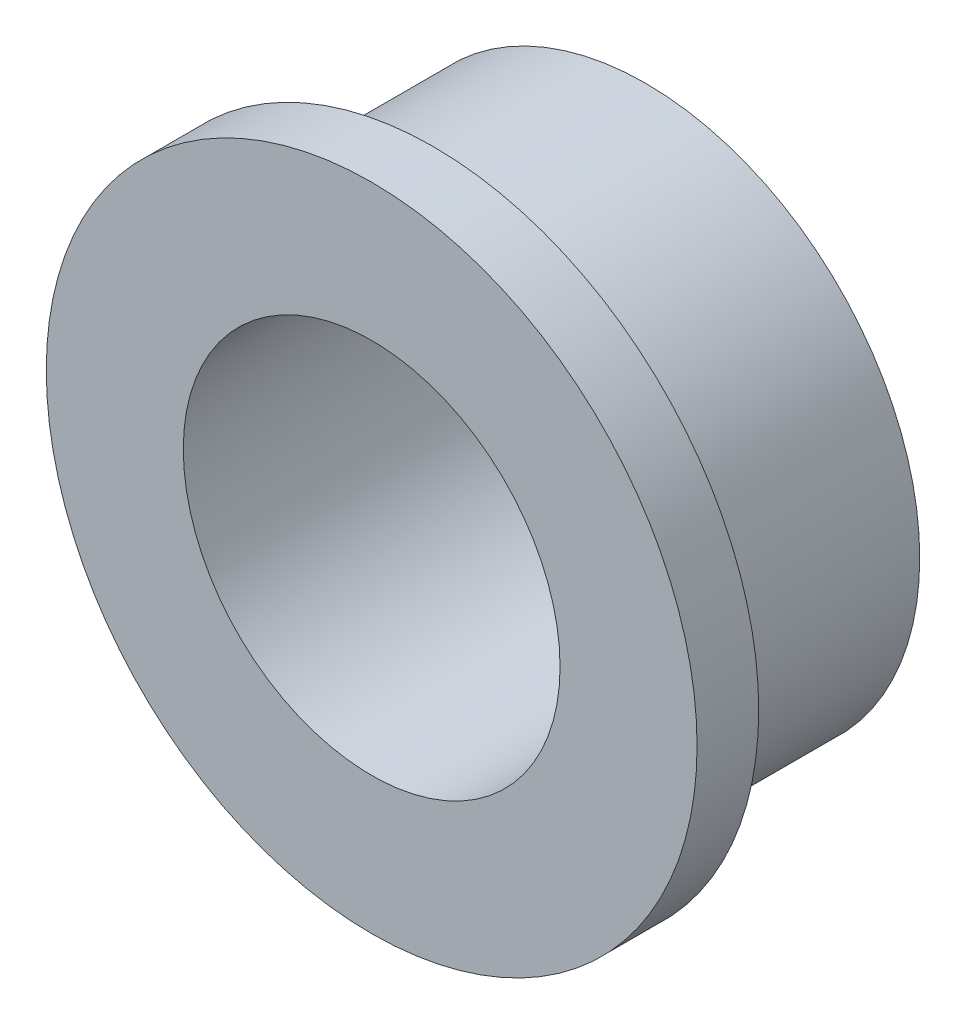
ISO-10303-21;
HEADER;
FILE_DESCRIPTION(('STEP AP214'),'2;1');
FILE_NAME('part.step','',(''),(''),'','','');
FILE_SCHEMA(('AUTOMOTIVE_DESIGN { 1 0 10303 214 1 1 1 1 }'));
ENDSEC;
DATA;
#1=APPLICATION_CONTEXT('core data for automotive mechanical design processes');
#2=APPLICATION_PROTOCOL_DEFINITION('international standard','automotive_design',2000,#1);
#3=PRODUCT_CONTEXT('',#1,'mechanical');
#4=PRODUCT('Part','Part','',(#3));
#5=PRODUCT_RELATED_PRODUCT_CATEGORY('part','',(#4));
#6=PRODUCT_DEFINITION_FORMATION('','',#4);
#7=PRODUCT_DEFINITION_CONTEXT('part definition',#1,'design');
#8=PRODUCT_DEFINITION('design','',#6,#7);
#9=PRODUCT_DEFINITION_SHAPE('','',#8);
#10=(LENGTH_UNIT() NAMED_UNIT(*) SI_UNIT(.MILLI.,.METRE.));
#11=(NAMED_UNIT(*) PLANE_ANGLE_UNIT() SI_UNIT($,.RADIAN.));
#12=(NAMED_UNIT(*) SI_UNIT($,.STERADIAN.) SOLID_ANGLE_UNIT());
#13=UNCERTAINTY_MEASURE_WITH_UNIT(LENGTH_MEASURE(1.E-05),#10,'distance_accuracy_value','');
#14=(GEOMETRIC_REPRESENTATION_CONTEXT(3) GLOBAL_UNCERTAINTY_ASSIGNED_CONTEXT((#13)) GLOBAL_UNIT_ASSIGNED_CONTEXT((#10,
#11,#12)) REPRESENTATION_CONTEXT('',''));
#15=CARTESIAN_POINT('',(0.,0.,0.));
#16=DIRECTION('',(0.,0.,1.));
#17=DIRECTION('',(1.,0.,0.));
#18=AXIS2_PLACEMENT_3D('',#15,#16,#17);
#19=CARTESIAN_POINT('',(0.,0.,3.1));
#20=DIRECTION('',(0.,0.,-1.));
#21=DIRECTION('',(-1.,0.,0.));
#22=AXIS2_PLACEMENT_3D('',#19,#20,#21);
#23=CYLINDRICAL_SURFACE('',#22,4.);
#24=CARTESIAN_POINT('',(0.,0.,3.1));
#25=DIRECTION('',(0.,0.,1.));
#26=DIRECTION('',(1.,0.,0.));
#27=AXIS2_PLACEMENT_3D('',#24,#25,#26);
#28=CIRCLE('',#27,4.);
#29=CARTESIAN_POINT('',(4.,0.,3.1));
#30=VERTEX_POINT('',#29);
#31=EDGE_CURVE('E10',#30,#30,#28,.T.);
#32=ORIENTED_EDGE('',*,*,#31,.F.);
#33=EDGE_LOOP('',(#32));
#34=FACE_BOUND('',#33,.T.);
#35=CARTESIAN_POINT('',(0.,0.,0.));
#36=DIRECTION('',(0.,0.,1.));
#37=DIRECTION('',(1.,0.,0.));
#38=AXIS2_PLACEMENT_3D('',#35,#36,#37);
#39=CIRCLE('',#38,4.);
#40=CARTESIAN_POINT('',(4.,0.,0.));
#41=VERTEX_POINT('',#40);
#42=EDGE_CURVE('E37',#41,#41,#39,.T.);
#43=ORIENTED_EDGE('',*,*,#42,.T.);
#44=EDGE_LOOP('',(#43));
#45=FACE_BOUND('',#44,.T.);
#46=ADVANCED_FACE('F34',(#34,#45),#23,.T.);
#47=CARTESIAN_POINT('',(0.,0.,0.));
#48=DIRECTION('',(0.,0.,1.));
#49=DIRECTION('',(1.,0.,0.));
#50=AXIS2_PLACEMENT_3D('',#47,#48,#49);
#51=PLANE('',#50);
#52=CARTESIAN_POINT('',(0.,0.,0.));
#53=DIRECTION('',(0.,0.,-1.));
#54=DIRECTION('',(-1.,0.,0.));
#55=AXIS2_PLACEMENT_3D('',#52,#53,#54);
#56=CIRCLE('',#55,2.75);
#57=CARTESIAN_POINT('',(-2.75,0.,0.));
#58=VERTEX_POINT('',#57);
#59=EDGE_CURVE('E52',#58,#58,#56,.T.);
#60=ORIENTED_EDGE('',*,*,#59,.F.);
#61=EDGE_LOOP('',(#60));
#62=FACE_BOUND('',#61,.T.);
#63=ORIENTED_EDGE('',*,*,#42,.F.);
#64=EDGE_LOOP('',(#63));
#65=FACE_BOUND('',#64,.T.);
#66=ADVANCED_FACE('F68',(#62,#65),#51,.F.);
#67=CARTESIAN_POINT('',(0.,0.,4.));
#68=DIRECTION('',(0.,0.,-1.));
#69=DIRECTION('',(-1.,0.,0.));
#70=AXIS2_PLACEMENT_3D('',#67,#68,#69);
#71=CYLINDRICAL_SURFACE('',#70,4.75);
#72=CARTESIAN_POINT('',(0.,0.,4.));
#73=DIRECTION('',(0.,0.,1.));
#74=DIRECTION('',(1.,0.,0.));
#75=AXIS2_PLACEMENT_3D('',#72,#73,#74);
#76=CIRCLE('',#75,4.75);
#77=CARTESIAN_POINT('',(4.75,0.,4.));
#78=VERTEX_POINT('',#77);
#79=EDGE_CURVE('E44',#78,#78,#76,.T.);
#80=ORIENTED_EDGE('',*,*,#79,.F.);
#81=EDGE_LOOP('',(#80));
#82=FACE_BOUND('',#81,.T.);
#83=CARTESIAN_POINT('',(0.,0.,3.1));
#84=DIRECTION('',(0.,0.,1.));
#85=DIRECTION('',(1.,0.,0.));
#86=AXIS2_PLACEMENT_3D('',#83,#84,#85);
#87=CIRCLE('',#86,4.75);
#88=CARTESIAN_POINT('',(4.75,0.,3.1));
#89=VERTEX_POINT('',#88);
#90=EDGE_CURVE('E46',#89,#89,#87,.T.);
#91=ORIENTED_EDGE('',*,*,#90,.T.);
#92=EDGE_LOOP('',(#91));
#93=FACE_BOUND('',#92,.T.);
#94=ADVANCED_FACE('F71',(#82,#93),#71,.T.);
#95=CARTESIAN_POINT('',(0.,0.,4.));
#96=DIRECTION('',(0.,0.,1.));
#97=DIRECTION('',(1.,0.,0.));
#98=AXIS2_PLACEMENT_3D('',#95,#96,#97);
#99=PLANE('',#98);
#100=CARTESIAN_POINT('',(0.,0.,4.));
#101=DIRECTION('',(0.,0.,-1.));
#102=DIRECTION('',(-1.,0.,0.));
#103=AXIS2_PLACEMENT_3D('',#100,#101,#102);
#104=CIRCLE('',#103,2.75);
#105=CARTESIAN_POINT('',(-2.75,0.,4.));
#106=VERTEX_POINT('',#105);
#107=EDGE_CURVE('E49',#106,#106,#104,.T.);
#108=ORIENTED_EDGE('',*,*,#107,.T.);
#109=EDGE_LOOP('',(#108));
#110=FACE_BOUND('',#109,.T.);
#111=ORIENTED_EDGE('',*,*,#79,.T.);
#112=EDGE_LOOP('',(#111));
#113=FACE_BOUND('',#112,.T.);
#114=ADVANCED_FACE('F58',(#110,#113),#99,.T.);
#115=CARTESIAN_POINT('',(0.,0.,3.1));
#116=DIRECTION('',(0.,0.,1.));
#117=DIRECTION('',(1.,0.,0.));
#118=AXIS2_PLACEMENT_3D('',#115,#116,#117);
#119=PLANE('',#118);
#120=ORIENTED_EDGE('',*,*,#31,.T.);
#121=EDGE_LOOP('',(#120));
#122=FACE_BOUND('',#121,.T.);
#123=ORIENTED_EDGE('',*,*,#90,.F.);
#124=EDGE_LOOP('',(#123));
#125=FACE_BOUND('',#124,.T.);
#126=ADVANCED_FACE('F64',(#122,#125),#119,.F.);
#127=CARTESIAN_POINT('',(0.,0.,4.));
#128=DIRECTION('',(0.,0.,-1.));
#129=DIRECTION('',(-1.,0.,0.));
#130=AXIS2_PLACEMENT_3D('',#127,#128,#129);
#131=CYLINDRICAL_SURFACE('',#130,2.75);
#132=ORIENTED_EDGE('',*,*,#107,.F.);
#133=EDGE_LOOP('',(#132));
#134=FACE_BOUND('',#133,.T.);
#135=ORIENTED_EDGE('',*,*,#59,.T.);
#136=EDGE_LOOP('',(#135));
#137=FACE_BOUND('',#136,.T.);
#138=ADVANCED_FACE('F61',(#134,#137),#131,.F.);
#139=CLOSED_SHELL('',(#46,#66,#94,#114,#126,#138));
#140=MANIFOLD_SOLID_BREP('B2',#139);
#141=ADVANCED_BREP_SHAPE_REPRESENTATION('',(#18,#140),#14);
#142=SHAPE_DEFINITION_REPRESENTATION(#9,#141);
ENDSEC;
END-ISO-10303-21;
